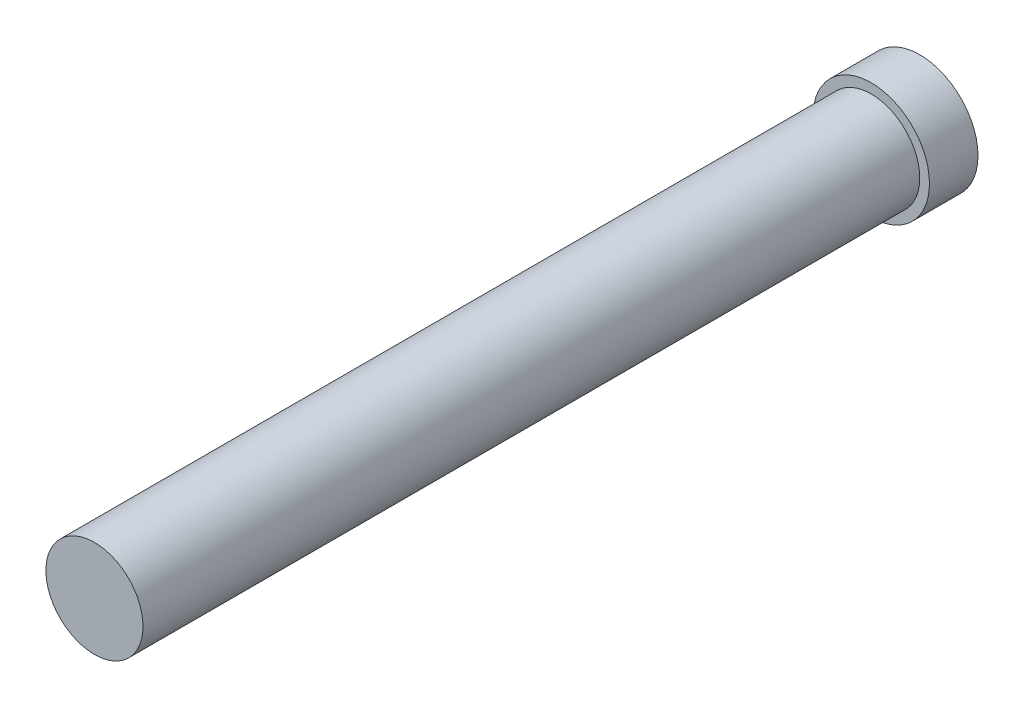
ISO-10303-21;
HEADER;
FILE_DESCRIPTION(('STEP AP214'),'2;1');
FILE_NAME('part.step','',(''),(''),'','','');
FILE_SCHEMA(('AUTOMOTIVE_DESIGN { 1 0 10303 214 1 1 1 1 }'));
ENDSEC;
DATA;
#1=APPLICATION_CONTEXT('core data for automotive mechanical design processes');
#2=APPLICATION_PROTOCOL_DEFINITION('international standard','automotive_design',2000,#1);
#3=PRODUCT_CONTEXT('',#1,'mechanical');
#4=PRODUCT('Part','Part','',(#3));
#5=PRODUCT_RELATED_PRODUCT_CATEGORY('part','',(#4));
#6=PRODUCT_DEFINITION_FORMATION('','',#4);
#7=PRODUCT_DEFINITION_CONTEXT('part definition',#1,'design');
#8=PRODUCT_DEFINITION('design','',#6,#7);
#9=PRODUCT_DEFINITION_SHAPE('','',#8);
#10=(LENGTH_UNIT() NAMED_UNIT(*) SI_UNIT(.MILLI.,.METRE.));
#11=(NAMED_UNIT(*) PLANE_ANGLE_UNIT() SI_UNIT($,.RADIAN.));
#12=(NAMED_UNIT(*) SI_UNIT($,.STERADIAN.) SOLID_ANGLE_UNIT());
#13=UNCERTAINTY_MEASURE_WITH_UNIT(LENGTH_MEASURE(1.E-05),#10,'distance_accuracy_value','');
#14=(GEOMETRIC_REPRESENTATION_CONTEXT(3) GLOBAL_UNCERTAINTY_ASSIGNED_CONTEXT((#13)) GLOBAL_UNIT_ASSIGNED_CONTEXT((#10,
#11,#12)) REPRESENTATION_CONTEXT('',''));
#15=CARTESIAN_POINT('',(0.,0.,0.));
#16=DIRECTION('',(0.,0.,1.));
#17=DIRECTION('',(1.,0.,0.));
#18=AXIS2_PLACEMENT_3D('',#15,#16,#17);
#19=CARTESIAN_POINT('',(0.,0.,6.35));
#20=DIRECTION('',(0.,0.,-1.));
#21=DIRECTION('',(-1.,0.,0.));
#22=AXIS2_PLACEMENT_3D('',#19,#20,#21);
#23=CYLINDRICAL_SURFACE('',#22,7.62);
#24=CARTESIAN_POINT('',(0.,0.,6.35));
#25=DIRECTION('',(0.,0.,1.));
#26=DIRECTION('',(1.,0.,0.));
#27=AXIS2_PLACEMENT_3D('',#24,#25,#26);
#28=CIRCLE('',#27,7.62);
#29=CARTESIAN_POINT('',(7.62,0.,6.35));
#30=VERTEX_POINT('',#29);
#31=EDGE_CURVE('E45',#30,#30,#28,.T.);
#32=ORIENTED_EDGE('',*,*,#31,.F.);
#33=EDGE_LOOP('',(#32));
#34=FACE_BOUND('',#33,.T.);
#35=CARTESIAN_POINT('',(0.,0.,0.));
#36=DIRECTION('',(0.,0.,1.));
#37=DIRECTION('',(1.,0.,0.));
#38=AXIS2_PLACEMENT_3D('',#35,#36,#37);
#39=CIRCLE('',#38,7.62);
#40=CARTESIAN_POINT('',(7.62,0.,0.));
#41=VERTEX_POINT('',#40);
#42=EDGE_CURVE('E41',#41,#41,#39,.T.);
#43=ORIENTED_EDGE('',*,*,#42,.T.);
#44=EDGE_LOOP('',(#43));
#45=FACE_BOUND('',#44,.T.);
#46=ADVANCED_FACE('F38',(#34,#45),#23,.T.);
#47=CARTESIAN_POINT('',(0.,0.,6.35));
#48=DIRECTION('',(0.,0.,1.));
#49=DIRECTION('',(1.,0.,0.));
#50=AXIS2_PLACEMENT_3D('',#47,#48,#49);
#51=PLANE('',#50);
#52=CARTESIAN_POINT('',(0.,0.,6.35));
#53=DIRECTION('',(0.,0.,1.));
#54=DIRECTION('',(1.,0.,0.));
#55=AXIS2_PLACEMENT_3D('',#52,#53,#54);
#56=CIRCLE('',#55,6.35);
#57=CARTESIAN_POINT('',(6.35,0.,6.35));
#58=VERTEX_POINT('',#57);
#59=EDGE_CURVE('E10',#58,#58,#56,.T.);
#60=ORIENTED_EDGE('',*,*,#59,.F.);
#61=EDGE_LOOP('',(#60));
#62=FACE_BOUND('',#61,.T.);
#63=ORIENTED_EDGE('',*,*,#31,.T.);
#64=EDGE_LOOP('',(#63));
#65=FACE_BOUND('',#64,.T.);
#66=ADVANCED_FACE('F62',(#62,#65),#51,.T.);
#67=CARTESIAN_POINT('',(0.,0.,0.));
#68=DIRECTION('',(0.,0.,1.));
#69=DIRECTION('',(1.,0.,0.));
#70=AXIS2_PLACEMENT_3D('',#67,#68,#69);
#71=PLANE('',#70);
#72=ORIENTED_EDGE('',*,*,#42,.F.);
#73=EDGE_LOOP('',(#72));
#74=FACE_BOUND('',#73,.T.);
#75=ADVANCED_FACE('F59',(#74),#71,.F.);
#76=CARTESIAN_POINT('',(0.,0.,107.95));
#77=DIRECTION('',(0.,0.,-1.));
#78=DIRECTION('',(-1.,0.,0.));
#79=AXIS2_PLACEMENT_3D('',#76,#77,#78);
#80=CYLINDRICAL_SURFACE('',#79,6.35);
#81=CARTESIAN_POINT('',(0.,0.,107.95));
#82=DIRECTION('',(0.,0.,1.));
#83=DIRECTION('',(1.,0.,0.));
#84=AXIS2_PLACEMENT_3D('',#81,#82,#83);
#85=CIRCLE('',#84,6.35);
#86=CARTESIAN_POINT('',(6.35,0.,107.95));
#87=VERTEX_POINT('',#86);
#88=EDGE_CURVE('E51',#87,#87,#85,.T.);
#89=ORIENTED_EDGE('',*,*,#88,.F.);
#90=EDGE_LOOP('',(#89));
#91=FACE_BOUND('',#90,.T.);
#92=ORIENTED_EDGE('',*,*,#59,.T.);
#93=EDGE_LOOP('',(#92));
#94=FACE_BOUND('',#93,.T.);
#95=ADVANCED_FACE('F61',(#91,#94),#80,.T.);
#96=CARTESIAN_POINT('',(0.,0.,107.95));
#97=DIRECTION('',(0.,0.,1.));
#98=DIRECTION('',(1.,0.,0.));
#99=AXIS2_PLACEMENT_3D('',#96,#97,#98);
#100=PLANE('',#99);
#101=ORIENTED_EDGE('',*,*,#88,.T.);
#102=EDGE_LOOP('',(#101));
#103=FACE_BOUND('',#102,.T.);
#104=ADVANCED_FACE('F68',(#103),#100,.T.);
#105=CLOSED_SHELL('',(#46,#66,#75,#95,#104));
#106=MANIFOLD_SOLID_BREP('B2',#105);
#107=ADVANCED_BREP_SHAPE_REPRESENTATION('',(#18,#106),#14);
#108=SHAPE_DEFINITION_REPRESENTATION(#9,#107);
ENDSEC;
END-ISO-10303-21;
